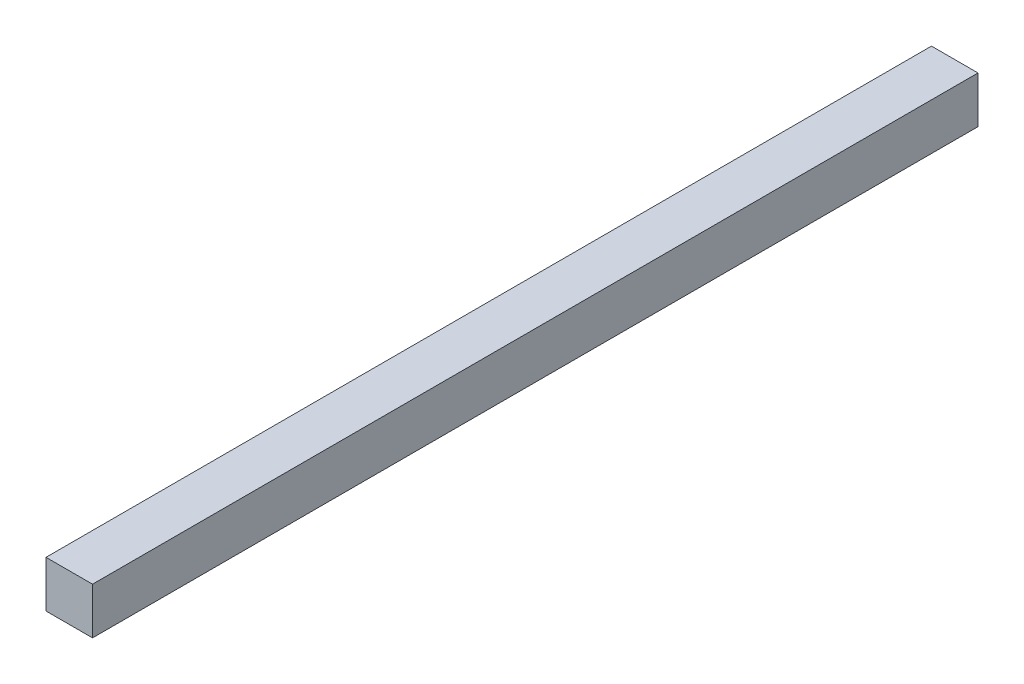
ISO-10303-21;
HEADER;
FILE_DESCRIPTION(('STEP AP214'),'2;1');
FILE_NAME('part.step','',(''),(''),'','','');
FILE_SCHEMA(('AUTOMOTIVE_DESIGN { 1 0 10303 214 1 1 1 1 }'));
ENDSEC;
DATA;
#1=APPLICATION_CONTEXT('core data for automotive mechanical design processes');
#2=APPLICATION_PROTOCOL_DEFINITION('international standard','automotive_design',2000,#1);
#3=PRODUCT_CONTEXT('',#1,'mechanical');
#4=PRODUCT('Part','Part','',(#3));
#5=PRODUCT_RELATED_PRODUCT_CATEGORY('part','',(#4));
#6=PRODUCT_DEFINITION_FORMATION('','',#4);
#7=PRODUCT_DEFINITION_CONTEXT('part definition',#1,'design');
#8=PRODUCT_DEFINITION('design','',#6,#7);
#9=PRODUCT_DEFINITION_SHAPE('','',#8);
#10=(LENGTH_UNIT() NAMED_UNIT(*) SI_UNIT(.MILLI.,.METRE.));
#11=(NAMED_UNIT(*) PLANE_ANGLE_UNIT() SI_UNIT($,.RADIAN.));
#12=(NAMED_UNIT(*) SI_UNIT($,.STERADIAN.) SOLID_ANGLE_UNIT());
#13=UNCERTAINTY_MEASURE_WITH_UNIT(LENGTH_MEASURE(1.E-05),#10,'distance_accuracy_value','');
#14=(GEOMETRIC_REPRESENTATION_CONTEXT(3) GLOBAL_UNCERTAINTY_ASSIGNED_CONTEXT((#13)) GLOBAL_UNIT_ASSIGNED_CONTEXT((#10,
#11,#12)) REPRESENTATION_CONTEXT('',''));
#15=CARTESIAN_POINT('',(0.,0.,0.));
#16=DIRECTION('',(0.,0.,1.));
#17=DIRECTION('',(1.,0.,0.));
#18=AXIS2_PLACEMENT_3D('',#15,#16,#17);
#19=CARTESIAN_POINT('',(-0.381,0.381,14.50000148));
#20=DIRECTION('',(0.,0.,1.));
#21=DIRECTION('',(1.,0.,0.));
#22=AXIS2_PLACEMENT_3D('',#19,#20,#21);
#23=PLANE('',#22);
#24=DIRECTION('',(0.,1.,0.));
#25=VECTOR('',#24,1.);
#26=CARTESIAN_POINT('',(-0.381,-0.381,14.50000148));
#27=LINE('',#26,#25);
#28=CARTESIAN_POINT('',(-0.381,-0.381,14.50000148));
#29=VERTEX_POINT('',#28);
#30=CARTESIAN_POINT('',(-0.381,0.381,14.50000148));
#31=VERTEX_POINT('',#30);
#32=EDGE_CURVE('E26',#29,#31,#27,.T.);
#33=ORIENTED_EDGE('',*,*,#32,.F.);
#34=DIRECTION('',(-1.,0.,0.));
#35=VECTOR('',#34,1.);
#36=CARTESIAN_POINT('',(0.381,-0.381,14.50000148));
#37=LINE('',#36,#35);
#38=CARTESIAN_POINT('',(0.381,-0.381,14.50000148));
#39=VERTEX_POINT('',#38);
#40=EDGE_CURVE('E106',#39,#29,#37,.T.);
#41=ORIENTED_EDGE('',*,*,#40,.F.);
#42=DIRECTION('',(0.,-1.,0.));
#43=VECTOR('',#42,1.);
#44=CARTESIAN_POINT('',(0.381,0.381,14.50000148));
#45=LINE('',#44,#43);
#46=CARTESIAN_POINT('',(0.381,0.381,14.50000148));
#47=VERTEX_POINT('',#46);
#48=EDGE_CURVE('E83',#47,#39,#45,.T.);
#49=ORIENTED_EDGE('',*,*,#48,.F.);
#50=DIRECTION('',(1.,0.,0.));
#51=VECTOR('',#50,1.);
#52=CARTESIAN_POINT('',(-0.381,0.381,14.50000148));
#53=LINE('',#52,#51);
#54=EDGE_CURVE('E87',#31,#47,#53,.T.);
#55=ORIENTED_EDGE('',*,*,#54,.F.);
#56=EDGE_LOOP('',(#33,#41,#49,#55));
#57=FACE_BOUND('',#56,.T.);
#58=ADVANCED_FACE('F17',(#57),#23,.T.);
#59=CARTESIAN_POINT('',(-0.381,0.381,0.));
#60=DIRECTION('',(0.,0.,1.));
#61=DIRECTION('',(1.,0.,0.));
#62=AXIS2_PLACEMENT_3D('',#59,#60,#61);
#63=PLANE('',#62);
#64=DIRECTION('',(1.,0.,0.));
#65=VECTOR('',#64,1.);
#66=CARTESIAN_POINT('',(-0.381,0.381,0.));
#67=LINE('',#66,#65);
#68=CARTESIAN_POINT('',(-0.381,0.381,0.));
#69=VERTEX_POINT('',#68);
#70=CARTESIAN_POINT('',(0.381,0.381,0.));
#71=VERTEX_POINT('',#70);
#72=EDGE_CURVE('E71',#69,#71,#67,.T.);
#73=ORIENTED_EDGE('',*,*,#72,.T.);
#74=DIRECTION('',(0.,-1.,0.));
#75=VECTOR('',#74,1.);
#76=CARTESIAN_POINT('',(0.381,0.381,0.));
#77=LINE('',#76,#75);
#78=CARTESIAN_POINT('',(0.381,-0.381,0.));
#79=VERTEX_POINT('',#78);
#80=EDGE_CURVE('E103',#71,#79,#77,.T.);
#81=ORIENTED_EDGE('',*,*,#80,.T.);
#82=DIRECTION('',(-1.,0.,0.));
#83=VECTOR('',#82,1.);
#84=CARTESIAN_POINT('',(0.381,-0.381,0.));
#85=LINE('',#84,#83);
#86=CARTESIAN_POINT('',(-0.381,-0.381,0.));
#87=VERTEX_POINT('',#86);
#88=EDGE_CURVE('E73',#79,#87,#85,.T.);
#89=ORIENTED_EDGE('',*,*,#88,.T.);
#90=DIRECTION('',(0.,1.,0.));
#91=VECTOR('',#90,1.);
#92=CARTESIAN_POINT('',(-0.381,-0.381,0.));
#93=LINE('',#92,#91);
#94=EDGE_CURVE('E11',#87,#69,#93,.T.);
#95=ORIENTED_EDGE('',*,*,#94,.T.);
#96=EDGE_LOOP('',(#73,#81,#89,#95));
#97=FACE_BOUND('',#96,.T.);
#98=ADVANCED_FACE('F19',(#97),#63,.F.);
#99=CARTESIAN_POINT('',(-0.381,-0.381,0.));
#100=DIRECTION('',(-1.,0.,0.));
#101=DIRECTION('',(0.,0.,1.));
#102=AXIS2_PLACEMENT_3D('',#99,#100,#101);
#103=PLANE('',#102);
#104=DIRECTION('',(0.,0.,1.));
#105=VECTOR('',#104,1.);
#106=CARTESIAN_POINT('',(-0.381,-0.381,0.));
#107=LINE('',#106,#105);
#108=EDGE_CURVE('E110',#87,#29,#107,.T.);
#109=ORIENTED_EDGE('',*,*,#108,.T.);
#110=ORIENTED_EDGE('',*,*,#32,.T.);
#111=DIRECTION('',(0.,0.,1.));
#112=VECTOR('',#111,1.);
#113=CARTESIAN_POINT('',(-0.381,0.381,0.));
#114=LINE('',#113,#112);
#115=EDGE_CURVE('E79',#69,#31,#114,.T.);
#116=ORIENTED_EDGE('',*,*,#115,.F.);
#117=ORIENTED_EDGE('',*,*,#94,.F.);
#118=EDGE_LOOP('',(#109,#110,#116,#117));
#119=FACE_BOUND('',#118,.T.);
#120=ADVANCED_FACE('F85',(#119),#103,.T.);
#121=CARTESIAN_POINT('',(0.381,-0.381,0.));
#122=DIRECTION('',(0.,-1.,0.));
#123=DIRECTION('',(0.,0.,-1.));
#124=AXIS2_PLACEMENT_3D('',#121,#122,#123);
#125=PLANE('',#124);
#126=DIRECTION('',(0.,0.,1.));
#127=VECTOR('',#126,1.);
#128=CARTESIAN_POINT('',(0.381,-0.381,0.));
#129=LINE('',#128,#127);
#130=EDGE_CURVE('E98',#79,#39,#129,.T.);
#131=ORIENTED_EDGE('',*,*,#130,.T.);
#132=ORIENTED_EDGE('',*,*,#40,.T.);
#133=ORIENTED_EDGE('',*,*,#108,.F.);
#134=ORIENTED_EDGE('',*,*,#88,.F.);
#135=EDGE_LOOP('',(#131,#132,#133,#134));
#136=FACE_BOUND('',#135,.T.);
#137=ADVANCED_FACE('F154',(#136),#125,.T.);
#138=CARTESIAN_POINT('',(0.381,0.381,0.));
#139=DIRECTION('',(1.,0.,0.));
#140=DIRECTION('',(0.,1.,0.));
#141=AXIS2_PLACEMENT_3D('',#138,#139,#140);
#142=PLANE('',#141);
#143=DIRECTION('',(0.,0.,1.));
#144=VECTOR('',#143,1.);
#145=CARTESIAN_POINT('',(0.381,0.381,0.));
#146=LINE('',#145,#144);
#147=EDGE_CURVE('E81',#71,#47,#146,.T.);
#148=ORIENTED_EDGE('',*,*,#147,.T.);
#149=ORIENTED_EDGE('',*,*,#48,.T.);
#150=ORIENTED_EDGE('',*,*,#130,.F.);
#151=ORIENTED_EDGE('',*,*,#80,.F.);
#152=EDGE_LOOP('',(#148,#149,#150,#151));
#153=FACE_BOUND('',#152,.T.);
#154=ADVANCED_FACE('F151',(#153),#142,.T.);
#155=CARTESIAN_POINT('',(-0.381,0.381,0.));
#156=DIRECTION('',(0.,1.,0.));
#157=DIRECTION('',(1.,0.,0.));
#158=AXIS2_PLACEMENT_3D('',#155,#156,#157);
#159=PLANE('',#158);
#160=ORIENTED_EDGE('',*,*,#115,.T.);
#161=ORIENTED_EDGE('',*,*,#54,.T.);
#162=ORIENTED_EDGE('',*,*,#147,.F.);
#163=ORIENTED_EDGE('',*,*,#72,.F.);
#164=EDGE_LOOP('',(#160,#161,#162,#163));
#165=FACE_BOUND('',#164,.T.);
#166=ADVANCED_FACE('F77',(#165),#159,.T.);
#167=CLOSED_SHELL('',(#58,#98,#120,#137,#154,#166));
#168=MANIFOLD_SOLID_BREP('B1',#167);
#169=ADVANCED_BREP_SHAPE_REPRESENTATION('',(#18,#168),#14);
#170=SHAPE_DEFINITION_REPRESENTATION(#9,#169);
ENDSEC;
END-ISO-10303-21;
